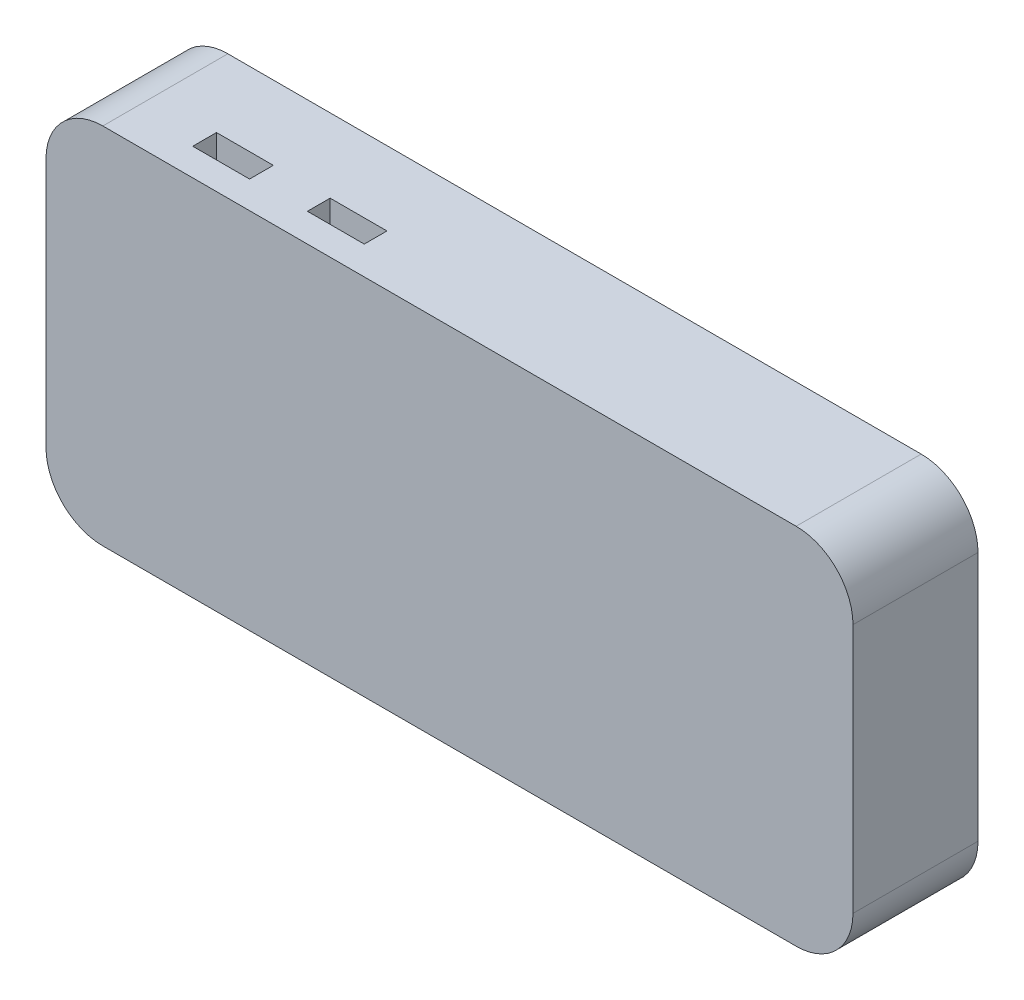
ISO-10303-21;
HEADER;
FILE_DESCRIPTION(('STEP AP214'),'2;1');
FILE_NAME('part.step','',(''),(''),'','','');
FILE_SCHEMA(('AUTOMOTIVE_DESIGN { 1 0 10303 214 1 1 1 1 }'));
ENDSEC;
DATA;
#1=APPLICATION_CONTEXT('core data for automotive mechanical design processes');
#2=APPLICATION_PROTOCOL_DEFINITION('international standard','automotive_design',2000,#1);
#3=PRODUCT_CONTEXT('',#1,'mechanical');
#4=PRODUCT('Part','Part','',(#3));
#5=PRODUCT_RELATED_PRODUCT_CATEGORY('part','',(#4));
#6=PRODUCT_DEFINITION_FORMATION('','',#4);
#7=PRODUCT_DEFINITION_CONTEXT('part definition',#1,'design');
#8=PRODUCT_DEFINITION('design','',#6,#7);
#9=PRODUCT_DEFINITION_SHAPE('','',#8);
#10=(LENGTH_UNIT() NAMED_UNIT(*) SI_UNIT(.MILLI.,.METRE.));
#11=(NAMED_UNIT(*) PLANE_ANGLE_UNIT() SI_UNIT($,.RADIAN.));
#12=(NAMED_UNIT(*) SI_UNIT($,.STERADIAN.) SOLID_ANGLE_UNIT());
#13=UNCERTAINTY_MEASURE_WITH_UNIT(LENGTH_MEASURE(1.E-05),#10,'distance_accuracy_value','');
#14=(GEOMETRIC_REPRESENTATION_CONTEXT(3) GLOBAL_UNCERTAINTY_ASSIGNED_CONTEXT((#13)) GLOBAL_UNIT_ASSIGNED_CONTEXT((#10,
#11,#12)) REPRESENTATION_CONTEXT('',''));
#15=CARTESIAN_POINT('',(0.,0.,0.));
#16=DIRECTION('',(0.,0.,1.));
#17=DIRECTION('',(1.,0.,0.));
#18=AXIS2_PLACEMENT_3D('',#15,#16,#17);
#19=CARTESIAN_POINT('',(61.,-22.,22.));
#20=DIRECTION('',(0.,0.,-1.));
#21=DIRECTION('',(-1.,0.,0.));
#22=AXIS2_PLACEMENT_3D('',#19,#20,#21);
#23=CYLINDRICAL_SURFACE('',#22,10.);
#24=CARTESIAN_POINT('',(61.,-22.,0.));
#25=DIRECTION('',(0.,0.,1.));
#26=DIRECTION('',(-1.,0.,0.));
#27=AXIS2_PLACEMENT_3D('',#24,#25,#26);
#28=CIRCLE('',#27,10.);
#29=CARTESIAN_POINT('',(60.9999999999999,-32.,0.));
#30=VERTEX_POINT('',#29);
#31=CARTESIAN_POINT('',(71.,-21.9999999999999,0.));
#32=VERTEX_POINT('',#31);
#33=EDGE_CURVE('E341',#30,#32,#28,.T.);
#34=ORIENTED_EDGE('',*,*,#33,.T.);
#35=DIRECTION('',(0.,0.,-1.));
#36=VECTOR('',#35,1.);
#37=CARTESIAN_POINT('',(71.,-21.9999999999999,22.));
#38=LINE('',#37,#36);
#39=CARTESIAN_POINT('',(71.,-21.9999999999999,22.));
#40=VERTEX_POINT('',#39);
#41=EDGE_CURVE('E399',#40,#32,#38,.T.);
#42=ORIENTED_EDGE('',*,*,#41,.F.);
#43=CARTESIAN_POINT('',(61.,-22.,22.));
#44=DIRECTION('',(0.,0.,1.));
#45=DIRECTION('',(-1.,0.,0.));
#46=AXIS2_PLACEMENT_3D('',#43,#44,#45);
#47=CIRCLE('',#46,10.);
#48=CARTESIAN_POINT('',(60.9999999999999,-32.,22.));
#49=VERTEX_POINT('',#48);
#50=EDGE_CURVE('E342',#49,#40,#47,.T.);
#51=ORIENTED_EDGE('',*,*,#50,.F.);
#52=DIRECTION('',(0.,0.,-1.));
#53=VECTOR('',#52,1.);
#54=CARTESIAN_POINT('',(60.9999999999999,-32.,22.));
#55=LINE('',#54,#53);
#56=EDGE_CURVE('E360',#49,#30,#55,.T.);
#57=ORIENTED_EDGE('',*,*,#56,.T.);
#58=EDGE_LOOP('',(#34,#42,#51,#57));
#59=FACE_BOUND('',#58,.T.);
#60=ADVANCED_FACE('F35',(#59),#23,.T.);
#61=CARTESIAN_POINT('',(71.,21.9999999999999,22.));
#62=DIRECTION('',(-1.,0.,0.));
#63=DIRECTION('',(0.,0.,1.));
#64=AXIS2_PLACEMENT_3D('',#61,#62,#63);
#65=PLANE('',#64);
#66=DIRECTION('',(0.,1.,0.));
#67=VECTOR('',#66,1.);
#68=CARTESIAN_POINT('',(71.,21.9999999999999,0.));
#69=LINE('',#68,#67);
#70=CARTESIAN_POINT('',(71.,21.9999999999999,0.));
#71=VERTEX_POINT('',#70);
#72=EDGE_CURVE('E363',#32,#71,#69,.T.);
#73=ORIENTED_EDGE('',*,*,#72,.T.);
#74=DIRECTION('',(0.,0.,-1.));
#75=VECTOR('',#74,1.);
#76=CARTESIAN_POINT('',(71.,21.9999999999999,22.));
#77=LINE('',#76,#75);
#78=CARTESIAN_POINT('',(71.,21.9999999999999,22.));
#79=VERTEX_POINT('',#78);
#80=EDGE_CURVE('E396',#79,#71,#77,.T.);
#81=ORIENTED_EDGE('',*,*,#80,.F.);
#82=DIRECTION('',(0.,1.,0.));
#83=VECTOR('',#82,1.);
#84=CARTESIAN_POINT('',(71.,21.9999999999999,22.));
#85=LINE('',#84,#83);
#86=EDGE_CURVE('E345',#40,#79,#85,.T.);
#87=ORIENTED_EDGE('',*,*,#86,.F.);
#88=ORIENTED_EDGE('',*,*,#41,.T.);
#89=EDGE_LOOP('',(#73,#81,#87,#88));
#90=FACE_BOUND('',#89,.T.);
#91=ADVANCED_FACE('F483',(#90),#65,.F.);
#92=CARTESIAN_POINT('',(61.,22.,22.));
#93=DIRECTION('',(0.,0.,-1.));
#94=DIRECTION('',(-1.,0.,0.));
#95=AXIS2_PLACEMENT_3D('',#92,#93,#94);
#96=CYLINDRICAL_SURFACE('',#95,10.);
#97=CARTESIAN_POINT('',(61.,22.,0.));
#98=DIRECTION('',(0.,0.,1.));
#99=DIRECTION('',(1.,0.,0.));
#100=AXIS2_PLACEMENT_3D('',#97,#98,#99);
#101=CIRCLE('',#100,10.);
#102=CARTESIAN_POINT('',(60.9999999999999,32.,0.));
#103=VERTEX_POINT('',#102);
#104=EDGE_CURVE('E365',#71,#103,#101,.T.);
#105=ORIENTED_EDGE('',*,*,#104,.T.);
#106=DIRECTION('',(0.,0.,-1.));
#107=VECTOR('',#106,1.);
#108=CARTESIAN_POINT('',(60.9999999999999,32.,22.));
#109=LINE('',#108,#107);
#110=CARTESIAN_POINT('',(60.9999999999999,32.,22.));
#111=VERTEX_POINT('',#110);
#112=EDGE_CURVE('E393',#111,#103,#109,.T.);
#113=ORIENTED_EDGE('',*,*,#112,.F.);
#114=CARTESIAN_POINT('',(61.,22.,22.));
#115=DIRECTION('',(0.,0.,1.));
#116=DIRECTION('',(1.,0.,0.));
#117=AXIS2_PLACEMENT_3D('',#114,#115,#116);
#118=CIRCLE('',#117,10.);
#119=EDGE_CURVE('E348',#79,#111,#118,.T.);
#120=ORIENTED_EDGE('',*,*,#119,.F.);
#121=ORIENTED_EDGE('',*,*,#80,.T.);
#122=EDGE_LOOP('',(#105,#113,#120,#121));
#123=FACE_BOUND('',#122,.T.);
#124=ADVANCED_FACE('F488',(#123),#96,.T.);
#125=CARTESIAN_POINT('',(-60.9999999999999,32.,22.));
#126=DIRECTION('',(0.,-1.,0.));
#127=DIRECTION('',(0.,0.,-1.));
#128=AXIS2_PLACEMENT_3D('',#125,#126,#127);
#129=PLANE('',#128);
#130=DIRECTION('',(1.,0.,0.));
#131=VECTOR('',#130,1.);
#132=CARTESIAN_POINT('',(-30.,32.,17.));
#133=LINE('',#132,#131);
#134=CARTESIAN_POINT('',(-30.,32.,17.));
#135=VERTEX_POINT('',#134);
#136=CARTESIAN_POINT('',(-20.,32.,17.));
#137=VERTEX_POINT('',#136);
#138=EDGE_CURVE('E236',#135,#137,#133,.T.);
#139=ORIENTED_EDGE('',*,*,#138,.F.);
#140=DIRECTION('',(0.,0.,1.));
#141=VECTOR('',#140,1.);
#142=CARTESIAN_POINT('',(-30.,32.,13.));
#143=LINE('',#142,#141);
#144=CARTESIAN_POINT('',(-30.,32.,13.));
#145=VERTEX_POINT('',#144);
#146=EDGE_CURVE('E49',#145,#135,#143,.T.);
#147=ORIENTED_EDGE('',*,*,#146,.F.);
#148=DIRECTION('',(-1.,0.,0.));
#149=VECTOR('',#148,1.);
#150=CARTESIAN_POINT('',(-30.,32.,13.));
#151=LINE('',#150,#149);
#152=CARTESIAN_POINT('',(-20.,32.,13.));
#153=VERTEX_POINT('',#152);
#154=EDGE_CURVE('E227',#153,#145,#151,.T.);
#155=ORIENTED_EDGE('',*,*,#154,.F.);
#156=DIRECTION('',(0.,0.,-1.));
#157=VECTOR('',#156,1.);
#158=CARTESIAN_POINT('',(-20.,32.,13.));
#159=LINE('',#158,#157);
#160=EDGE_CURVE('E230',#137,#153,#159,.T.);
#161=ORIENTED_EDGE('',*,*,#160,.F.);
#162=EDGE_LOOP('',(#139,#147,#155,#161));
#163=FACE_BOUND('',#162,.T.);
#164=DIRECTION('',(-1.,0.,0.));
#165=VECTOR('',#164,1.);
#166=CARTESIAN_POINT('',(-40.,32.,13.));
#167=LINE('',#166,#165);
#168=CARTESIAN_POINT('',(-40.,32.,13.));
#169=VERTEX_POINT('',#168);
#170=CARTESIAN_POINT('',(-50.,32.,13.));
#171=VERTEX_POINT('',#170);
#172=EDGE_CURVE('E262',#169,#171,#167,.T.);
#173=ORIENTED_EDGE('',*,*,#172,.F.);
#174=DIRECTION('',(0.,0.,-1.));
#175=VECTOR('',#174,1.);
#176=CARTESIAN_POINT('',(-40.,32.,13.));
#177=LINE('',#176,#175);
#178=CARTESIAN_POINT('',(-40.,32.,17.1784435192591));
#179=VERTEX_POINT('',#178);
#180=EDGE_CURVE('E57',#179,#169,#177,.T.);
#181=ORIENTED_EDGE('',*,*,#180,.F.);
#182=DIRECTION('',(1.,0.,0.));
#183=VECTOR('',#182,1.);
#184=CARTESIAN_POINT('',(-40.,32.,17.1784435192591));
#185=LINE('',#184,#183);
#186=CARTESIAN_POINT('',(-50.,32.,17.1784435192591));
#187=VERTEX_POINT('',#186);
#188=EDGE_CURVE('E251',#187,#179,#185,.T.);
#189=ORIENTED_EDGE('',*,*,#188,.F.);
#190=DIRECTION('',(0.,0.,1.));
#191=VECTOR('',#190,1.);
#192=CARTESIAN_POINT('',(-50.,32.,13.));
#193=LINE('',#192,#191);
#194=EDGE_CURVE('E265',#171,#187,#193,.T.);
#195=ORIENTED_EDGE('',*,*,#194,.F.);
#196=EDGE_LOOP('',(#173,#181,#189,#195));
#197=FACE_BOUND('',#196,.T.);
#198=DIRECTION('',(-1.,0.,0.));
#199=VECTOR('',#198,1.);
#200=CARTESIAN_POINT('',(-60.9999999999999,32.,0.));
#201=LINE('',#200,#199);
#202=CARTESIAN_POINT('',(-60.9999999999999,32.,0.));
#203=VERTEX_POINT('',#202);
#204=EDGE_CURVE('E367',#103,#203,#201,.T.);
#205=ORIENTED_EDGE('',*,*,#204,.T.);
#206=DIRECTION('',(0.,0.,-1.));
#207=VECTOR('',#206,1.);
#208=CARTESIAN_POINT('',(-60.9999999999999,32.,22.));
#209=LINE('',#208,#207);
#210=CARTESIAN_POINT('',(-60.9999999999999,32.,22.));
#211=VERTEX_POINT('',#210);
#212=EDGE_CURVE('E389',#211,#203,#209,.T.);
#213=ORIENTED_EDGE('',*,*,#212,.F.);
#214=DIRECTION('',(-1.,0.,0.));
#215=VECTOR('',#214,1.);
#216=CARTESIAN_POINT('',(-60.9999999999999,32.,22.));
#217=LINE('',#216,#215);
#218=EDGE_CURVE('E350',#111,#211,#217,.T.);
#219=ORIENTED_EDGE('',*,*,#218,.F.);
#220=ORIENTED_EDGE('',*,*,#112,.T.);
#221=EDGE_LOOP('',(#205,#213,#219,#220));
#222=FACE_BOUND('',#221,.T.);
#223=ADVANCED_FACE('F497',(#163,#197,#222),#129,.F.);
#224=CARTESIAN_POINT('',(-61.,22.,22.));
#225=DIRECTION('',(0.,0.,-1.));
#226=DIRECTION('',(-1.,0.,0.));
#227=AXIS2_PLACEMENT_3D('',#224,#225,#226);
#228=CYLINDRICAL_SURFACE('',#227,10.);
#229=DIRECTION('',(0.,0.,-1.));
#230=VECTOR('',#229,1.);
#231=CARTESIAN_POINT('',(-71.,21.9999999999999,22.));
#232=LINE('',#231,#230);
#233=CARTESIAN_POINT('',(-71.,21.9999999999999,13.));
#234=VERTEX_POINT('',#233);
#235=CARTESIAN_POINT('',(-71.,21.9999999999999,9.));
#236=VERTEX_POINT('',#235);
#237=EDGE_CURVE('E390',#234,#236,#232,.T.);
#238=ORIENTED_EDGE('',*,*,#237,.F.);
#239=CARTESIAN_POINT('',(-61.,22.,13.));
#240=DIRECTION('',(0.,0.,-1.));
#241=DIRECTION('',(0.,1.,0.));
#242=AXIS2_PLACEMENT_3D('',#239,#240,#241);
#243=CIRCLE('',#242,10.);
#244=CARTESIAN_POINT('',(-70.1651513899117,26.,13.));
#245=VERTEX_POINT('',#244);
#246=EDGE_CURVE('E338',#234,#245,#243,.T.);
#247=ORIENTED_EDGE('',*,*,#246,.T.);
#248=DIRECTION('',(0.,0.,-1.));
#249=VECTOR('',#248,1.);
#250=CARTESIAN_POINT('',(-70.1651513899117,26.,22.));
#251=LINE('',#250,#249);
#252=CARTESIAN_POINT('',(-70.1651513899117,26.,18.));
#253=VERTEX_POINT('',#252);
#254=EDGE_CURVE('E11',#245,#253,#251,.F.);
#255=ORIENTED_EDGE('',*,*,#254,.T.);
#256=CARTESIAN_POINT('',(-61.,22.,18.));
#257=DIRECTION('',(0.,0.,1.));
#258=DIRECTION('',(0.,-1.,0.));
#259=AXIS2_PLACEMENT_3D('',#256,#257,#258);
#260=CIRCLE('',#259,10.);
#261=CARTESIAN_POINT('',(-71.,21.9999999999999,18.));
#262=VERTEX_POINT('',#261);
#263=EDGE_CURVE('E335',#253,#262,#260,.T.);
#264=ORIENTED_EDGE('',*,*,#263,.T.);
#265=CARTESIAN_POINT('',(-71.,21.9999999999999,22.));
#266=VERTEX_POINT('',#265);
#267=EDGE_CURVE('E386',#266,#262,#232,.T.);
#268=ORIENTED_EDGE('',*,*,#267,.F.);
#269=CARTESIAN_POINT('',(-61.,22.,22.));
#270=DIRECTION('',(0.,0.,1.));
#271=DIRECTION('',(-1.,0.,0.));
#272=AXIS2_PLACEMENT_3D('',#269,#270,#271);
#273=CIRCLE('',#272,10.);
#274=EDGE_CURVE('E352',#211,#266,#273,.T.);
#275=ORIENTED_EDGE('',*,*,#274,.F.);
#276=ORIENTED_EDGE('',*,*,#212,.T.);
#277=CARTESIAN_POINT('',(-61.,22.,0.));
#278=DIRECTION('',(0.,0.,1.));
#279=DIRECTION('',(-1.,0.,0.));
#280=AXIS2_PLACEMENT_3D('',#277,#278,#279);
#281=CIRCLE('',#280,10.);
#282=CARTESIAN_POINT('',(-71.,21.9999999999999,0.));
#283=VERTEX_POINT('',#282);
#284=EDGE_CURVE('E369',#203,#283,#281,.T.);
#285=ORIENTED_EDGE('',*,*,#284,.T.);
#286=CARTESIAN_POINT('',(-71.,21.9999999999999,4.));
#287=VERTEX_POINT('',#286);
#288=EDGE_CURVE('E385',#287,#283,#232,.T.);
#289=ORIENTED_EDGE('',*,*,#288,.F.);
#290=CARTESIAN_POINT('',(-61.,22.,4.));
#291=DIRECTION('',(0.,0.,-1.));
#292=DIRECTION('',(0.,1.,0.));
#293=AXIS2_PLACEMENT_3D('',#290,#291,#292);
#294=CIRCLE('',#293,10.);
#295=CARTESIAN_POINT('',(-70.1651513899117,26.,4.));
#296=VERTEX_POINT('',#295);
#297=EDGE_CURVE('E332',#287,#296,#294,.T.);
#298=ORIENTED_EDGE('',*,*,#297,.T.);
#299=DIRECTION('',(0.,0.,-1.));
#300=VECTOR('',#299,1.);
#301=CARTESIAN_POINT('',(-70.1651513899117,26.,22.));
#302=LINE('',#301,#300);
#303=CARTESIAN_POINT('',(-70.1651513899117,26.,9.));
#304=VERTEX_POINT('',#303);
#305=EDGE_CURVE('E42',#296,#304,#302,.F.);
#306=ORIENTED_EDGE('',*,*,#305,.T.);
#307=CARTESIAN_POINT('',(-61.,22.,9.));
#308=DIRECTION('',(0.,0.,1.));
#309=DIRECTION('',(0.,-1.,0.));
#310=AXIS2_PLACEMENT_3D('',#307,#308,#309);
#311=CIRCLE('',#310,10.);
#312=EDGE_CURVE('E298',#304,#236,#311,.T.);
#313=ORIENTED_EDGE('',*,*,#312,.T.);
#314=EDGE_LOOP('',(#238,#247,#255,#264,#268,#275,#276,#285,#289,#298,#306,#313));
#315=FACE_BOUND('',#314,.T.);
#316=ADVANCED_FACE('F410',(#315),#228,.T.);
#317=CARTESIAN_POINT('',(-71.,21.9999999999999,22.));
#318=DIRECTION('',(1.,0.,0.));
#319=DIRECTION('',(0.,1.,0.));
#320=AXIS2_PLACEMENT_3D('',#317,#318,#319);
#321=PLANE('',#320);
#322=DIRECTION('',(0.,0.,1.));
#323=VECTOR('',#322,1.);
#324=CARTESIAN_POINT('',(-71.,13.,13.));
#325=LINE('',#324,#323);
#326=CARTESIAN_POINT('',(-71.,13.,13.));
#327=VERTEX_POINT('',#326);
#328=CARTESIAN_POINT('',(-71.,13.,18.));
#329=VERTEX_POINT('',#328);
#330=EDGE_CURVE('E290',#327,#329,#325,.T.);
#331=ORIENTED_EDGE('',*,*,#330,.F.);
#332=DIRECTION('',(0.,1.,0.));
#333=VECTOR('',#332,1.);
#334=CARTESIAN_POINT('',(-71.,21.9999999999999,13.));
#335=LINE('',#334,#333);
#336=EDGE_CURVE('E405',#327,#234,#335,.T.);
#337=ORIENTED_EDGE('',*,*,#336,.T.);
#338=ORIENTED_EDGE('',*,*,#237,.T.);
#339=DIRECTION('',(0.,1.,0.));
#340=VECTOR('',#339,1.);
#341=CARTESIAN_POINT('',(-71.,26.,9.));
#342=LINE('',#341,#340);
#343=CARTESIAN_POINT('',(-71.,13.,9.));
#344=VERTEX_POINT('',#343);
#345=EDGE_CURVE('E309',#344,#236,#342,.T.);
#346=ORIENTED_EDGE('',*,*,#345,.F.);
#347=DIRECTION('',(0.,0.,1.));
#348=VECTOR('',#347,1.);
#349=CARTESIAN_POINT('',(-71.,13.,4.));
#350=LINE('',#349,#348);
#351=CARTESIAN_POINT('',(-71.,13.,4.));
#352=VERTEX_POINT('',#351);
#353=EDGE_CURVE('E243',#352,#344,#350,.T.);
#354=ORIENTED_EDGE('',*,*,#353,.F.);
#355=DIRECTION('',(0.,1.,0.));
#356=VECTOR('',#355,1.);
#357=CARTESIAN_POINT('',(-71.,21.9999999999999,4.));
#358=LINE('',#357,#356);
#359=EDGE_CURVE('E402',#352,#287,#358,.T.);
#360=ORIENTED_EDGE('',*,*,#359,.T.);
#361=ORIENTED_EDGE('',*,*,#288,.T.);
#362=DIRECTION('',(0.,-1.,0.));
#363=VECTOR('',#362,1.);
#364=CARTESIAN_POINT('',(-71.,21.9999999999999,0.));
#365=LINE('',#364,#363);
#366=CARTESIAN_POINT('',(-71.,-21.9999999999999,0.));
#367=VERTEX_POINT('',#366);
#368=EDGE_CURVE('E372',#283,#367,#365,.T.);
#369=ORIENTED_EDGE('',*,*,#368,.T.);
#370=DIRECTION('',(0.,0.,-1.));
#371=VECTOR('',#370,1.);
#372=CARTESIAN_POINT('',(-71.,-21.9999999999999,22.));
#373=LINE('',#372,#371);
#374=CARTESIAN_POINT('',(-71.,-21.9999999999999,22.));
#375=VERTEX_POINT('',#374);
#376=EDGE_CURVE('E382',#375,#367,#373,.T.);
#377=ORIENTED_EDGE('',*,*,#376,.F.);
#378=DIRECTION('',(0.,-1.,0.));
#379=VECTOR('',#378,1.);
#380=CARTESIAN_POINT('',(-71.,21.9999999999999,22.));
#381=LINE('',#380,#379);
#382=EDGE_CURVE('E354',#266,#375,#381,.T.);
#383=ORIENTED_EDGE('',*,*,#382,.F.);
#384=ORIENTED_EDGE('',*,*,#267,.T.);
#385=DIRECTION('',(0.,1.,0.));
#386=VECTOR('',#385,1.);
#387=CARTESIAN_POINT('',(-71.,26.,18.));
#388=LINE('',#387,#386);
#389=EDGE_CURVE('E280',#329,#262,#388,.T.);
#390=ORIENTED_EDGE('',*,*,#389,.F.);
#391=EDGE_LOOP('',(#331,#337,#338,#346,#354,#360,#361,#369,#377,#383,#384,#390));
#392=FACE_BOUND('',#391,.T.);
#393=ADVANCED_FACE('F430',(#392),#321,.F.);
#394=CARTESIAN_POINT('',(-61.,-22.,22.));
#395=DIRECTION('',(0.,0.,-1.));
#396=DIRECTION('',(-1.,0.,0.));
#397=AXIS2_PLACEMENT_3D('',#394,#395,#396);
#398=CYLINDRICAL_SURFACE('',#397,10.);
#399=CARTESIAN_POINT('',(-61.,-22.,0.));
#400=DIRECTION('',(0.,0.,1.));
#401=DIRECTION('',(-1.,0.,0.));
#402=AXIS2_PLACEMENT_3D('',#399,#400,#401);
#403=CIRCLE('',#402,10.);
#404=CARTESIAN_POINT('',(-60.9999999999999,-32.,0.));
#405=VERTEX_POINT('',#404);
#406=EDGE_CURVE('E374',#367,#405,#403,.T.);
#407=ORIENTED_EDGE('',*,*,#406,.T.);
#408=DIRECTION('',(0.,0.,-1.));
#409=VECTOR('',#408,1.);
#410=CARTESIAN_POINT('',(-60.9999999999999,-32.,22.));
#411=LINE('',#410,#409);
#412=CARTESIAN_POINT('',(-60.9999999999999,-32.,22.));
#413=VERTEX_POINT('',#412);
#414=EDGE_CURVE('E379',#413,#405,#411,.T.);
#415=ORIENTED_EDGE('',*,*,#414,.F.);
#416=CARTESIAN_POINT('',(-61.,-22.,22.));
#417=DIRECTION('',(0.,0.,1.));
#418=DIRECTION('',(-1.,0.,0.));
#419=AXIS2_PLACEMENT_3D('',#416,#417,#418);
#420=CIRCLE('',#419,10.);
#421=EDGE_CURVE('E356',#375,#413,#420,.T.);
#422=ORIENTED_EDGE('',*,*,#421,.F.);
#423=ORIENTED_EDGE('',*,*,#376,.T.);
#424=EDGE_LOOP('',(#407,#415,#422,#423));
#425=FACE_BOUND('',#424,.T.);
#426=ADVANCED_FACE('F445',(#425),#398,.T.);
#427=CARTESIAN_POINT('',(-60.9999999999999,-32.,22.));
#428=DIRECTION('',(0.,1.,0.));
#429=DIRECTION('',(0.,0.,1.));
#430=AXIS2_PLACEMENT_3D('',#427,#428,#429);
#431=PLANE('',#430);
#432=DIRECTION('',(1.,0.,0.));
#433=VECTOR('',#432,1.);
#434=CARTESIAN_POINT('',(-60.9999999999999,-32.,0.));
#435=LINE('',#434,#433);
#436=EDGE_CURVE('E346',#405,#30,#435,.T.);
#437=ORIENTED_EDGE('',*,*,#436,.T.);
#438=ORIENTED_EDGE('',*,*,#56,.F.);
#439=DIRECTION('',(1.,0.,0.));
#440=VECTOR('',#439,1.);
#441=CARTESIAN_POINT('',(-60.9999999999999,-32.,22.));
#442=LINE('',#441,#440);
#443=EDGE_CURVE('E358',#413,#49,#442,.T.);
#444=ORIENTED_EDGE('',*,*,#443,.F.);
#445=ORIENTED_EDGE('',*,*,#414,.T.);
#446=EDGE_LOOP('',(#437,#438,#444,#445));
#447=FACE_BOUND('',#446,.T.);
#448=ADVANCED_FACE('F449',(#447),#431,.F.);
#449=CARTESIAN_POINT('',(61.,-22.,22.));
#450=DIRECTION('',(0.,0.,-1.));
#451=DIRECTION('',(-1.,0.,0.));
#452=AXIS2_PLACEMENT_3D('',#449,#450,#451);
#453=PLANE('',#452);
#454=ORIENTED_EDGE('',*,*,#50,.T.);
#455=ORIENTED_EDGE('',*,*,#86,.T.);
#456=ORIENTED_EDGE('',*,*,#119,.T.);
#457=ORIENTED_EDGE('',*,*,#218,.T.);
#458=ORIENTED_EDGE('',*,*,#274,.T.);
#459=ORIENTED_EDGE('',*,*,#382,.T.);
#460=ORIENTED_EDGE('',*,*,#421,.T.);
#461=ORIENTED_EDGE('',*,*,#443,.T.);
#462=EDGE_LOOP('',(#454,#455,#456,#457,#458,#459,#460,#461));
#463=FACE_BOUND('',#462,.T.);
#464=ADVANCED_FACE('F453',(#463),#453,.F.);
#465=CARTESIAN_POINT('',(61.,-22.,0.));
#466=DIRECTION('',(0.,0.,-1.));
#467=DIRECTION('',(-1.,0.,0.));
#468=AXIS2_PLACEMENT_3D('',#465,#466,#467);
#469=PLANE('',#468);
#470=ORIENTED_EDGE('',*,*,#33,.F.);
#471=ORIENTED_EDGE('',*,*,#436,.F.);
#472=ORIENTED_EDGE('',*,*,#406,.F.);
#473=ORIENTED_EDGE('',*,*,#368,.F.);
#474=ORIENTED_EDGE('',*,*,#284,.F.);
#475=ORIENTED_EDGE('',*,*,#204,.F.);
#476=ORIENTED_EDGE('',*,*,#104,.F.);
#477=ORIENTED_EDGE('',*,*,#72,.F.);
#478=EDGE_LOOP('',(#470,#471,#472,#473,#474,#475,#476,#477));
#479=FACE_BOUND('',#478,.T.);
#480=ADVANCED_FACE('F441',(#479),#469,.T.);
#481=CARTESIAN_POINT('',(-61.,26.,4.));
#482=DIRECTION('',(0.,1.,0.));
#483=DIRECTION('',(-1.,0.,0.));
#484=AXIS2_PLACEMENT_3D('',#481,#482,#483);
#485=PLANE('',#484);
#486=DIRECTION('',(-1.,0.,0.));
#487=VECTOR('',#486,1.);
#488=CARTESIAN_POINT('',(-61.,26.,4.));
#489=LINE('',#488,#487);
#490=CARTESIAN_POINT('',(-61.,26.,4.));
#491=VERTEX_POINT('',#490);
#492=EDGE_CURVE('E293',#491,#296,#489,.T.);
#493=ORIENTED_EDGE('',*,*,#492,.F.);
#494=DIRECTION('',(0.,0.,-1.));
#495=VECTOR('',#494,1.);
#496=CARTESIAN_POINT('',(-61.,26.,4.));
#497=LINE('',#496,#495);
#498=CARTESIAN_POINT('',(-61.,26.,9.));
#499=VERTEX_POINT('',#498);
#500=EDGE_CURVE('E315',#499,#491,#497,.T.);
#501=ORIENTED_EDGE('',*,*,#500,.F.);
#502=DIRECTION('',(-1.,0.,0.));
#503=VECTOR('',#502,1.);
#504=CARTESIAN_POINT('',(-61.,26.,9.));
#505=LINE('',#504,#503);
#506=EDGE_CURVE('E324',#499,#304,#505,.T.);
#507=ORIENTED_EDGE('',*,*,#506,.T.);
#508=ORIENTED_EDGE('',*,*,#305,.F.);
#509=EDGE_LOOP('',(#493,#501,#507,#508));
#510=FACE_BOUND('',#509,.T.);
#511=ADVANCED_FACE('F414',(#510),#485,.F.);
#512=CARTESIAN_POINT('',(-61.,26.,4.));
#513=DIRECTION('',(0.,0.,-1.));
#514=DIRECTION('',(0.,1.,0.));
#515=AXIS2_PLACEMENT_3D('',#512,#513,#514);
#516=PLANE('',#515);
#517=ORIENTED_EDGE('',*,*,#359,.F.);
#518=DIRECTION('',(-1.,0.,0.));
#519=VECTOR('',#518,1.);
#520=CARTESIAN_POINT('',(-61.,13.,4.));
#521=LINE('',#520,#519);
#522=CARTESIAN_POINT('',(-61.,13.,4.));
#523=VERTEX_POINT('',#522);
#524=EDGE_CURVE('E318',#523,#352,#521,.T.);
#525=ORIENTED_EDGE('',*,*,#524,.F.);
#526=DIRECTION('',(0.,-1.,0.));
#527=VECTOR('',#526,1.);
#528=CARTESIAN_POINT('',(-61.,26.,4.));
#529=LINE('',#528,#527);
#530=EDGE_CURVE('E305',#491,#523,#529,.T.);
#531=ORIENTED_EDGE('',*,*,#530,.F.);
#532=ORIENTED_EDGE('',*,*,#492,.T.);
#533=ORIENTED_EDGE('',*,*,#297,.F.);
#534=EDGE_LOOP('',(#517,#525,#531,#532,#533));
#535=FACE_BOUND('',#534,.T.);
#536=ADVANCED_FACE('F419',(#535),#516,.F.);
#537=CARTESIAN_POINT('',(-61.,26.,9.));
#538=DIRECTION('',(0.,0.,1.));
#539=DIRECTION('',(0.,-1.,0.));
#540=AXIS2_PLACEMENT_3D('',#537,#538,#539);
#541=PLANE('',#540);
#542=ORIENTED_EDGE('',*,*,#506,.F.);
#543=DIRECTION('',(0.,1.,0.));
#544=VECTOR('',#543,1.);
#545=CARTESIAN_POINT('',(-61.,26.,9.));
#546=LINE('',#545,#544);
#547=CARTESIAN_POINT('',(-61.,13.,9.));
#548=VERTEX_POINT('',#547);
#549=EDGE_CURVE('E312',#548,#499,#546,.T.);
#550=ORIENTED_EDGE('',*,*,#549,.F.);
#551=DIRECTION('',(-1.,0.,0.));
#552=VECTOR('',#551,1.);
#553=CARTESIAN_POINT('',(-61.,13.,9.));
#554=LINE('',#553,#552);
#555=EDGE_CURVE('E327',#548,#344,#554,.T.);
#556=ORIENTED_EDGE('',*,*,#555,.T.);
#557=ORIENTED_EDGE('',*,*,#345,.T.);
#558=ORIENTED_EDGE('',*,*,#312,.F.);
#559=EDGE_LOOP('',(#542,#550,#556,#557,#558));
#560=FACE_BOUND('',#559,.T.);
#561=ADVANCED_FACE('F425',(#560),#541,.F.);
#562=CARTESIAN_POINT('',(-61.,13.,4.));
#563=DIRECTION('',(0.,-1.,0.));
#564=DIRECTION('',(1.,0.,0.));
#565=AXIS2_PLACEMENT_3D('',#562,#563,#564);
#566=PLANE('',#565);
#567=ORIENTED_EDGE('',*,*,#353,.T.);
#568=ORIENTED_EDGE('',*,*,#555,.F.);
#569=DIRECTION('',(0.,0.,1.));
#570=VECTOR('',#569,1.);
#571=CARTESIAN_POINT('',(-61.,13.,4.));
#572=LINE('',#571,#570);
#573=EDGE_CURVE('E308',#523,#548,#572,.T.);
#574=ORIENTED_EDGE('',*,*,#573,.F.);
#575=ORIENTED_EDGE('',*,*,#524,.T.);
#576=EDGE_LOOP('',(#567,#568,#574,#575));
#577=FACE_BOUND('',#576,.T.);
#578=ADVANCED_FACE('F521',(#577),#566,.F.);
#579=CARTESIAN_POINT('',(-61.,0.,0.));
#580=DIRECTION('',(-1.,0.,0.));
#581=DIRECTION('',(0.,-1.,0.));
#582=AXIS2_PLACEMENT_3D('',#579,#580,#581);
#583=PLANE('',#582);
#584=ORIENTED_EDGE('',*,*,#530,.T.);
#585=ORIENTED_EDGE('',*,*,#573,.T.);
#586=ORIENTED_EDGE('',*,*,#549,.T.);
#587=ORIENTED_EDGE('',*,*,#500,.T.);
#588=EDGE_LOOP('',(#584,#585,#586,#587));
#589=FACE_BOUND('',#588,.T.);
#590=ADVANCED_FACE('F422',(#589),#583,.T.);
#591=CARTESIAN_POINT('',(-61.,26.,13.));
#592=DIRECTION('',(0.,1.,0.));
#593=DIRECTION('',(-1.,0.,0.));
#594=AXIS2_PLACEMENT_3D('',#591,#592,#593);
#595=PLANE('',#594);
#596=DIRECTION('',(-1.,0.,0.));
#597=VECTOR('',#596,1.);
#598=CARTESIAN_POINT('',(-61.,26.,13.));
#599=LINE('',#598,#597);
#600=CARTESIAN_POINT('',(-61.,26.,13.));
#601=VERTEX_POINT('',#600);
#602=EDGE_CURVE('E295',#601,#245,#599,.T.);
#603=ORIENTED_EDGE('',*,*,#602,.F.);
#604=DIRECTION('',(0.,0.,-1.));
#605=VECTOR('',#604,1.);
#606=CARTESIAN_POINT('',(-61.,26.,13.));
#607=LINE('',#606,#605);
#608=CARTESIAN_POINT('',(-61.,26.,18.));
#609=VERTEX_POINT('',#608);
#610=EDGE_CURVE('E286',#609,#601,#607,.T.);
#611=ORIENTED_EDGE('',*,*,#610,.F.);
#612=DIRECTION('',(-1.,0.,0.));
#613=VECTOR('',#612,1.);
#614=CARTESIAN_POINT('',(-61.,26.,18.));
#615=LINE('',#614,#613);
#616=EDGE_CURVE('E299',#609,#253,#615,.T.);
#617=ORIENTED_EDGE('',*,*,#616,.T.);
#618=ORIENTED_EDGE('',*,*,#254,.F.);
#619=EDGE_LOOP('',(#603,#611,#617,#618));
#620=FACE_BOUND('',#619,.T.);
#621=ADVANCED_FACE('F463',(#620),#595,.F.);
#622=CARTESIAN_POINT('',(-61.,26.,13.));
#623=DIRECTION('',(0.,0.,-1.));
#624=DIRECTION('',(0.,1.,0.));
#625=AXIS2_PLACEMENT_3D('',#622,#623,#624);
#626=PLANE('',#625);
#627=ORIENTED_EDGE('',*,*,#336,.F.);
#628=DIRECTION('',(-1.,0.,0.));
#629=VECTOR('',#628,1.);
#630=CARTESIAN_POINT('',(-61.,13.,13.));
#631=LINE('',#630,#629);
#632=CARTESIAN_POINT('',(-61.,13.,13.));
#633=VERTEX_POINT('',#632);
#634=EDGE_CURVE('E289',#633,#327,#631,.T.);
#635=ORIENTED_EDGE('',*,*,#634,.F.);
#636=DIRECTION('',(0.,-1.,0.));
#637=VECTOR('',#636,1.);
#638=CARTESIAN_POINT('',(-61.,26.,13.));
#639=LINE('',#638,#637);
#640=EDGE_CURVE('E276',#601,#633,#639,.T.);
#641=ORIENTED_EDGE('',*,*,#640,.F.);
#642=ORIENTED_EDGE('',*,*,#602,.T.);
#643=ORIENTED_EDGE('',*,*,#246,.F.);
#644=EDGE_LOOP('',(#627,#635,#641,#642,#643));
#645=FACE_BOUND('',#644,.T.);
#646=ADVANCED_FACE('F471',(#645),#626,.F.);
#647=CARTESIAN_POINT('',(-61.,26.,18.));
#648=DIRECTION('',(0.,0.,1.));
#649=DIRECTION('',(0.,-1.,0.));
#650=AXIS2_PLACEMENT_3D('',#647,#648,#649);
#651=PLANE('',#650);
#652=ORIENTED_EDGE('',*,*,#616,.F.);
#653=DIRECTION('',(0.,1.,0.));
#654=VECTOR('',#653,1.);
#655=CARTESIAN_POINT('',(-61.,26.,18.));
#656=LINE('',#655,#654);
#657=CARTESIAN_POINT('',(-61.,13.,18.));
#658=VERTEX_POINT('',#657);
#659=EDGE_CURVE('E283',#658,#609,#656,.T.);
#660=ORIENTED_EDGE('',*,*,#659,.F.);
#661=DIRECTION('',(-1.,0.,0.));
#662=VECTOR('',#661,1.);
#663=CARTESIAN_POINT('',(-61.,13.,18.));
#664=LINE('',#663,#662);
#665=EDGE_CURVE('E302',#658,#329,#664,.T.);
#666=ORIENTED_EDGE('',*,*,#665,.T.);
#667=ORIENTED_EDGE('',*,*,#389,.T.);
#668=ORIENTED_EDGE('',*,*,#263,.F.);
#669=EDGE_LOOP('',(#652,#660,#666,#667,#668));
#670=FACE_BOUND('',#669,.T.);
#671=ADVANCED_FACE('F459',(#670),#651,.F.);
#672=CARTESIAN_POINT('',(-61.,13.,13.));
#673=DIRECTION('',(0.,-1.,0.));
#674=DIRECTION('',(1.,0.,0.));
#675=AXIS2_PLACEMENT_3D('',#672,#673,#674);
#676=PLANE('',#675);
#677=ORIENTED_EDGE('',*,*,#330,.T.);
#678=ORIENTED_EDGE('',*,*,#665,.F.);
#679=DIRECTION('',(0.,0.,1.));
#680=VECTOR('',#679,1.);
#681=CARTESIAN_POINT('',(-61.,13.,13.));
#682=LINE('',#681,#680);
#683=EDGE_CURVE('E279',#633,#658,#682,.T.);
#684=ORIENTED_EDGE('',*,*,#683,.F.);
#685=ORIENTED_EDGE('',*,*,#634,.T.);
#686=EDGE_LOOP('',(#677,#678,#684,#685));
#687=FACE_BOUND('',#686,.T.);
#688=ADVANCED_FACE('F469',(#687),#676,.F.);
#689=CARTESIAN_POINT('',(-61.,0.,0.));
#690=DIRECTION('',(-1.,0.,0.));
#691=DIRECTION('',(0.,-1.,0.));
#692=AXIS2_PLACEMENT_3D('',#689,#690,#691);
#693=PLANE('',#692);
#694=ORIENTED_EDGE('',*,*,#640,.T.);
#695=ORIENTED_EDGE('',*,*,#683,.T.);
#696=ORIENTED_EDGE('',*,*,#659,.T.);
#697=ORIENTED_EDGE('',*,*,#610,.T.);
#698=EDGE_LOOP('',(#694,#695,#696,#697));
#699=FACE_BOUND('',#698,.T.);
#700=ADVANCED_FACE('F466',(#699),#693,.T.);
#701=CARTESIAN_POINT('',(-40.,27.,13.));
#702=DIRECTION('',(1.,0.,0.));
#703=DIRECTION('',(0.,0.,-1.));
#704=AXIS2_PLACEMENT_3D('',#701,#702,#703);
#705=PLANE('',#704);
#706=ORIENTED_EDGE('',*,*,#180,.T.);
#707=DIRECTION('',(0.,1.,0.));
#708=VECTOR('',#707,1.);
#709=CARTESIAN_POINT('',(-40.,27.,13.));
#710=LINE('',#709,#708);
#711=CARTESIAN_POINT('',(-40.,27.,13.));
#712=VERTEX_POINT('',#711);
#713=EDGE_CURVE('E260',#712,#169,#710,.T.);
#714=ORIENTED_EDGE('',*,*,#713,.F.);
#715=DIRECTION('',(0.,0.,-1.));
#716=VECTOR('',#715,1.);
#717=CARTESIAN_POINT('',(-40.,27.,13.));
#718=LINE('',#717,#716);
#719=CARTESIAN_POINT('',(-40.,27.,17.1784435192591));
#720=VERTEX_POINT('',#719);
#721=EDGE_CURVE('E247',#720,#712,#718,.T.);
#722=ORIENTED_EDGE('',*,*,#721,.F.);
#723=DIRECTION('',(0.,1.,0.));
#724=VECTOR('',#723,1.);
#725=CARTESIAN_POINT('',(-40.,27.,17.1784435192591));
#726=LINE('',#725,#724);
#727=EDGE_CURVE('E237',#720,#179,#726,.T.);
#728=ORIENTED_EDGE('',*,*,#727,.T.);
#729=EDGE_LOOP('',(#706,#714,#722,#728));
#730=FACE_BOUND('',#729,.T.);
#731=ADVANCED_FACE('F562',(#730),#705,.F.);
#732=CARTESIAN_POINT('',(-40.,27.,17.1784435192591));
#733=DIRECTION('',(0.,0.,1.));
#734=DIRECTION('',(1.,0.,0.));
#735=AXIS2_PLACEMENT_3D('',#732,#733,#734);
#736=PLANE('',#735);
#737=ORIENTED_EDGE('',*,*,#188,.T.);
#738=ORIENTED_EDGE('',*,*,#727,.F.);
#739=DIRECTION('',(1.,0.,0.));
#740=VECTOR('',#739,1.);
#741=CARTESIAN_POINT('',(-40.,27.,17.1784435192591));
#742=LINE('',#741,#740);
#743=CARTESIAN_POINT('',(-50.,27.,17.1784435192591));
#744=VERTEX_POINT('',#743);
#745=EDGE_CURVE('E257',#744,#720,#742,.T.);
#746=ORIENTED_EDGE('',*,*,#745,.F.);
#747=DIRECTION('',(0.,1.,0.));
#748=VECTOR('',#747,1.);
#749=CARTESIAN_POINT('',(-50.,27.,17.1784435192591));
#750=LINE('',#749,#748);
#751=EDGE_CURVE('E271',#744,#187,#750,.T.);
#752=ORIENTED_EDGE('',*,*,#751,.T.);
#753=EDGE_LOOP('',(#737,#738,#746,#752));
#754=FACE_BOUND('',#753,.T.);
#755=ADVANCED_FACE('F578',(#754),#736,.F.);
#756=CARTESIAN_POINT('',(-50.,27.,13.));
#757=DIRECTION('',(-1.,0.,0.));
#758=DIRECTION('',(0.,0.,1.));
#759=AXIS2_PLACEMENT_3D('',#756,#757,#758);
#760=PLANE('',#759);
#761=ORIENTED_EDGE('',*,*,#194,.T.);
#762=ORIENTED_EDGE('',*,*,#751,.F.);
#763=DIRECTION('',(0.,0.,1.));
#764=VECTOR('',#763,1.);
#765=CARTESIAN_POINT('',(-50.,27.,13.));
#766=LINE('',#765,#764);
#767=CARTESIAN_POINT('',(-50.,27.,13.));
#768=VERTEX_POINT('',#767);
#769=EDGE_CURVE('E254',#768,#744,#766,.T.);
#770=ORIENTED_EDGE('',*,*,#769,.F.);
#771=DIRECTION('',(0.,1.,0.));
#772=VECTOR('',#771,1.);
#773=CARTESIAN_POINT('',(-50.,27.,13.));
#774=LINE('',#773,#772);
#775=EDGE_CURVE('E273',#768,#171,#774,.T.);
#776=ORIENTED_EDGE('',*,*,#775,.T.);
#777=EDGE_LOOP('',(#761,#762,#770,#776));
#778=FACE_BOUND('',#777,.T.);
#779=ADVANCED_FACE('F587',(#778),#760,.F.);
#780=CARTESIAN_POINT('',(-40.,27.,13.));
#781=DIRECTION('',(0.,0.,-1.));
#782=DIRECTION('',(-1.,0.,0.));
#783=AXIS2_PLACEMENT_3D('',#780,#781,#782);
#784=PLANE('',#783);
#785=ORIENTED_EDGE('',*,*,#172,.T.);
#786=ORIENTED_EDGE('',*,*,#775,.F.);
#787=DIRECTION('',(-1.,0.,0.));
#788=VECTOR('',#787,1.);
#789=CARTESIAN_POINT('',(-40.,27.,13.));
#790=LINE('',#789,#788);
#791=EDGE_CURVE('E250',#712,#768,#790,.T.);
#792=ORIENTED_EDGE('',*,*,#791,.F.);
#793=ORIENTED_EDGE('',*,*,#713,.T.);
#794=EDGE_LOOP('',(#785,#786,#792,#793));
#795=FACE_BOUND('',#794,.T.);
#796=ADVANCED_FACE('F597',(#795),#784,.F.);
#797=CARTESIAN_POINT('',(0.,27.,0.));
#798=DIRECTION('',(0.,-1.,0.));
#799=DIRECTION('',(0.,0.,-1.));
#800=AXIS2_PLACEMENT_3D('',#797,#798,#799);
#801=PLANE('',#800);
#802=ORIENTED_EDGE('',*,*,#721,.T.);
#803=ORIENTED_EDGE('',*,*,#791,.T.);
#804=ORIENTED_EDGE('',*,*,#769,.T.);
#805=ORIENTED_EDGE('',*,*,#745,.T.);
#806=EDGE_LOOP('',(#802,#803,#804,#805));
#807=FACE_BOUND('',#806,.T.);
#808=ADVANCED_FACE('F607',(#807),#801,.F.);
#809=CARTESIAN_POINT('',(-30.,27.,13.));
#810=DIRECTION('',(-1.,0.,0.));
#811=DIRECTION('',(0.,0.,1.));
#812=AXIS2_PLACEMENT_3D('',#809,#810,#811);
#813=PLANE('',#812);
#814=ORIENTED_EDGE('',*,*,#146,.T.);
#815=DIRECTION('',(0.,1.,0.));
#816=VECTOR('',#815,1.);
#817=CARTESIAN_POINT('',(-30.,27.,17.));
#818=LINE('',#817,#816);
#819=CARTESIAN_POINT('',(-30.,27.,17.));
#820=VERTEX_POINT('',#819);
#821=EDGE_CURVE('E205',#820,#135,#818,.T.);
#822=ORIENTED_EDGE('',*,*,#821,.F.);
#823=DIRECTION('',(0.,0.,1.));
#824=VECTOR('',#823,1.);
#825=CARTESIAN_POINT('',(-30.,27.,13.));
#826=LINE('',#825,#824);
#827=CARTESIAN_POINT('',(-30.,27.,13.));
#828=VERTEX_POINT('',#827);
#829=EDGE_CURVE('E209',#828,#820,#826,.T.);
#830=ORIENTED_EDGE('',*,*,#829,.F.);
#831=DIRECTION('',(0.,1.,0.));
#832=VECTOR('',#831,1.);
#833=CARTESIAN_POINT('',(-30.,27.,13.));
#834=LINE('',#833,#832);
#835=EDGE_CURVE('E241',#828,#145,#834,.T.);
#836=ORIENTED_EDGE('',*,*,#835,.T.);
#837=EDGE_LOOP('',(#814,#822,#830,#836));
#838=FACE_BOUND('',#837,.T.);
#839=ADVANCED_FACE('F207',(#838),#813,.F.);
#840=CARTESIAN_POINT('',(-30.,27.,13.));
#841=DIRECTION('',(0.,0.,-1.));
#842=DIRECTION('',(-1.,0.,0.));
#843=AXIS2_PLACEMENT_3D('',#840,#841,#842);
#844=PLANE('',#843);
#845=ORIENTED_EDGE('',*,*,#154,.T.);
#846=ORIENTED_EDGE('',*,*,#835,.F.);
#847=DIRECTION('',(-1.,0.,0.));
#848=VECTOR('',#847,1.);
#849=CARTESIAN_POINT('',(-30.,27.,13.));
#850=LINE('',#849,#848);
#851=CARTESIAN_POINT('',(-20.,27.,13.));
#852=VERTEX_POINT('',#851);
#853=EDGE_CURVE('E215',#852,#828,#850,.T.);
#854=ORIENTED_EDGE('',*,*,#853,.F.);
#855=DIRECTION('',(0.,1.,0.));
#856=VECTOR('',#855,1.);
#857=CARTESIAN_POINT('',(-20.,27.,13.));
#858=LINE('',#857,#856);
#859=EDGE_CURVE('E244',#852,#153,#858,.T.);
#860=ORIENTED_EDGE('',*,*,#859,.T.);
#861=EDGE_LOOP('',(#845,#846,#854,#860));
#862=FACE_BOUND('',#861,.T.);
#863=ADVANCED_FACE('F626',(#862),#844,.F.);
#864=CARTESIAN_POINT('',(-20.,27.,13.));
#865=DIRECTION('',(1.,0.,0.));
#866=DIRECTION('',(0.,0.,-1.));
#867=AXIS2_PLACEMENT_3D('',#864,#865,#866);
#868=PLANE('',#867);
#869=ORIENTED_EDGE('',*,*,#160,.T.);
#870=ORIENTED_EDGE('',*,*,#859,.F.);
#871=DIRECTION('',(0.,0.,-1.));
#872=VECTOR('',#871,1.);
#873=CARTESIAN_POINT('',(-20.,27.,13.));
#874=LINE('',#873,#872);
#875=CARTESIAN_POINT('',(-20.,27.,17.));
#876=VERTEX_POINT('',#875);
#877=EDGE_CURVE('E223',#876,#852,#874,.T.);
#878=ORIENTED_EDGE('',*,*,#877,.F.);
#879=DIRECTION('',(0.,1.,0.));
#880=VECTOR('',#879,1.);
#881=CARTESIAN_POINT('',(-20.,27.,17.));
#882=LINE('',#881,#880);
#883=EDGE_CURVE('E214',#876,#137,#882,.T.);
#884=ORIENTED_EDGE('',*,*,#883,.T.);
#885=EDGE_LOOP('',(#869,#870,#878,#884));
#886=FACE_BOUND('',#885,.T.);
#887=ADVANCED_FACE('F635',(#886),#868,.F.);
#888=CARTESIAN_POINT('',(-30.,27.,17.));
#889=DIRECTION('',(0.,0.,1.));
#890=DIRECTION('',(1.,0.,0.));
#891=AXIS2_PLACEMENT_3D('',#888,#889,#890);
#892=PLANE('',#891);
#893=ORIENTED_EDGE('',*,*,#138,.T.);
#894=ORIENTED_EDGE('',*,*,#883,.F.);
#895=DIRECTION('',(1.,0.,0.));
#896=VECTOR('',#895,1.);
#897=CARTESIAN_POINT('',(-30.,27.,17.));
#898=LINE('',#897,#896);
#899=EDGE_CURVE('E218',#820,#876,#898,.T.);
#900=ORIENTED_EDGE('',*,*,#899,.F.);
#901=ORIENTED_EDGE('',*,*,#821,.T.);
#902=EDGE_LOOP('',(#893,#894,#900,#901));
#903=FACE_BOUND('',#902,.T.);
#904=ADVANCED_FACE('F219',(#903),#892,.F.);
#905=CARTESIAN_POINT('',(0.,27.,0.));
#906=DIRECTION('',(0.,1.,0.));
#907=DIRECTION('',(0.,0.,1.));
#908=AXIS2_PLACEMENT_3D('',#905,#906,#907);
#909=PLANE('',#908);
#910=ORIENTED_EDGE('',*,*,#829,.T.);
#911=ORIENTED_EDGE('',*,*,#899,.T.);
#912=ORIENTED_EDGE('',*,*,#877,.T.);
#913=ORIENTED_EDGE('',*,*,#853,.T.);
#914=EDGE_LOOP('',(#910,#911,#912,#913));
#915=FACE_BOUND('',#914,.T.);
#916=ADVANCED_FACE('F225',(#915),#909,.T.);
#917=CLOSED_SHELL('',(#60,#91,#124,#223,#316,#393,#426,#448,#464,#480,#511,#536,#561,#578,#590,
#621,#646,#671,#688,#700,#731,#755,#779,#796,#808,#839,#863,#887,#904,#916));
#918=MANIFOLD_SOLID_BREP('B2',#917);
#919=ADVANCED_BREP_SHAPE_REPRESENTATION('',(#18,#918),#14);
#920=SHAPE_DEFINITION_REPRESENTATION(#9,#919);
ENDSEC;
END-ISO-10303-21;
